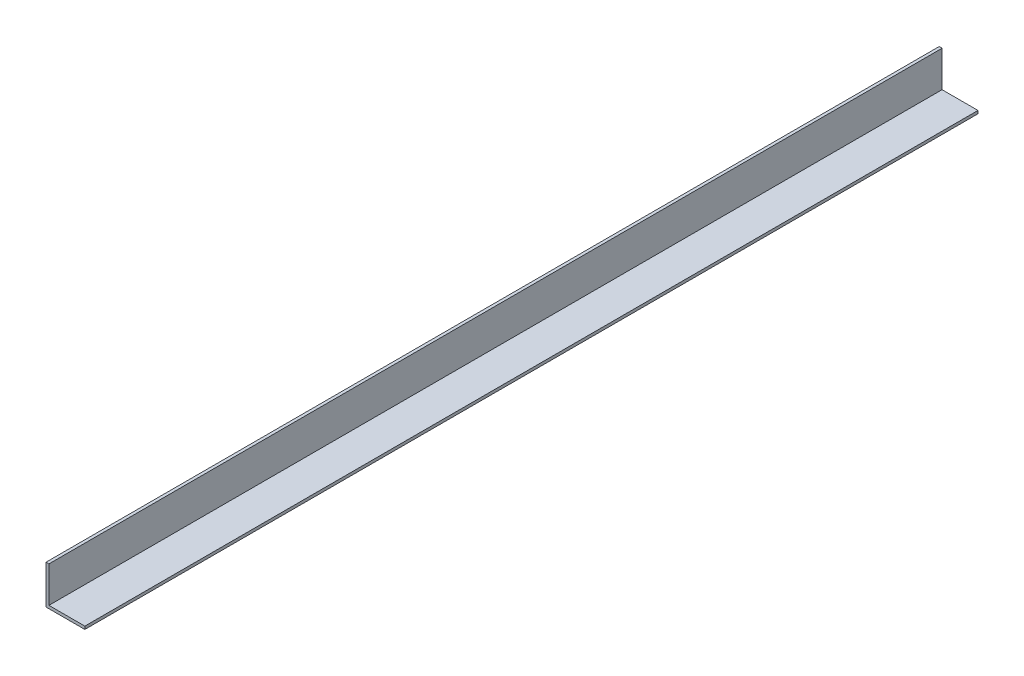
ISO-10303-21;
HEADER;
FILE_DESCRIPTION(('STEP AP214'),'2;1');
FILE_NAME('part.step','',(''),(''),'','','');
FILE_SCHEMA(('AUTOMOTIVE_DESIGN { 1 0 10303 214 1 1 1 1 }'));
ENDSEC;
DATA;
#1=APPLICATION_CONTEXT('core data for automotive mechanical design processes');
#2=APPLICATION_PROTOCOL_DEFINITION('international standard','automotive_design',2000,#1);
#3=PRODUCT_CONTEXT('',#1,'mechanical');
#4=PRODUCT('Part','Part','',(#3));
#5=PRODUCT_RELATED_PRODUCT_CATEGORY('part','',(#4));
#6=PRODUCT_DEFINITION_FORMATION('','',#4);
#7=PRODUCT_DEFINITION_CONTEXT('part definition',#1,'design');
#8=PRODUCT_DEFINITION('design','',#6,#7);
#9=PRODUCT_DEFINITION_SHAPE('','',#8);
#10=(LENGTH_UNIT() NAMED_UNIT(*) SI_UNIT(.MILLI.,.METRE.));
#11=(NAMED_UNIT(*) PLANE_ANGLE_UNIT() SI_UNIT($,.RADIAN.));
#12=(NAMED_UNIT(*) SI_UNIT($,.STERADIAN.) SOLID_ANGLE_UNIT());
#13=UNCERTAINTY_MEASURE_WITH_UNIT(LENGTH_MEASURE(1.E-05),#10,'distance_accuracy_value','');
#14=(GEOMETRIC_REPRESENTATION_CONTEXT(3) GLOBAL_UNCERTAINTY_ASSIGNED_CONTEXT((#13)) GLOBAL_UNIT_ASSIGNED_CONTEXT((#10,
#11,#12)) REPRESENTATION_CONTEXT('',''));
#15=CARTESIAN_POINT('',(0.,0.,0.));
#16=DIRECTION('',(0.,0.,1.));
#17=DIRECTION('',(1.,0.,0.));
#18=AXIS2_PLACEMENT_3D('',#15,#16,#17);
#19=CARTESIAN_POINT('',(1.5,0.,230.));
#20=DIRECTION('',(-1.,0.,0.));
#21=DIRECTION('',(0.,0.,1.));
#22=AXIS2_PLACEMENT_3D('',#19,#20,#21);
#23=PLANE('',#22);
#24=DIRECTION('',(0.,1.,0.));
#25=VECTOR('',#24,1.);
#26=CARTESIAN_POINT('',(1.5,0.,-230.));
#27=LINE('',#26,#25);
#28=CARTESIAN_POINT('',(1.5,1.5,-230.));
#29=VERTEX_POINT('',#28);
#30=CARTESIAN_POINT('',(1.5,20.,-230.));
#31=VERTEX_POINT('',#30);
#32=EDGE_CURVE('E120',#29,#31,#27,.T.);
#33=ORIENTED_EDGE('',*,*,#32,.T.);
#34=DIRECTION('',(0.,0.,-1.));
#35=VECTOR('',#34,1.);
#36=CARTESIAN_POINT('',(1.5,20.,230.));
#37=LINE('',#36,#35);
#38=CARTESIAN_POINT('',(1.5,20.,230.));
#39=VERTEX_POINT('',#38);
#40=EDGE_CURVE('E11',#39,#31,#37,.T.);
#41=ORIENTED_EDGE('',*,*,#40,.F.);
#42=DIRECTION('',(0.,1.,0.));
#43=VECTOR('',#42,1.);
#44=CARTESIAN_POINT('',(1.5,0.,230.));
#45=LINE('',#44,#43);
#46=CARTESIAN_POINT('',(1.5,1.5,230.));
#47=VERTEX_POINT('',#46);
#48=EDGE_CURVE('E85',#47,#39,#45,.T.);
#49=ORIENTED_EDGE('',*,*,#48,.F.);
#50=DIRECTION('',(0.,0.,-1.));
#51=VECTOR('',#50,1.);
#52=CARTESIAN_POINT('',(1.5,1.5,230.));
#53=LINE('',#52,#51);
#54=EDGE_CURVE('E116',#47,#29,#53,.T.);
#55=ORIENTED_EDGE('',*,*,#54,.T.);
#56=EDGE_LOOP('',(#33,#41,#49,#55));
#57=FACE_BOUND('',#56,.T.);
#58=ADVANCED_FACE('F39',(#57),#23,.F.);
#59=CARTESIAN_POINT('',(0.,20.,230.));
#60=DIRECTION('',(0.,1.,0.));
#61=DIRECTION('',(0.,0.,1.));
#62=AXIS2_PLACEMENT_3D('',#59,#60,#61);
#63=PLANE('',#62);
#64=DIRECTION('',(1.,0.,0.));
#65=VECTOR('',#64,1.);
#66=CARTESIAN_POINT('',(0.,20.,-230.));
#67=LINE('',#66,#65);
#68=CARTESIAN_POINT('',(0.,20.,-230.));
#69=VERTEX_POINT('',#68);
#70=EDGE_CURVE('E123',#69,#31,#67,.T.);
#71=ORIENTED_EDGE('',*,*,#70,.F.);
#72=DIRECTION('',(0.,0.,-1.));
#73=VECTOR('',#72,1.);
#74=CARTESIAN_POINT('',(0.,20.,230.));
#75=LINE('',#74,#73);
#76=CARTESIAN_POINT('',(0.,20.,230.));
#77=VERTEX_POINT('',#76);
#78=EDGE_CURVE('E47',#77,#69,#75,.T.);
#79=ORIENTED_EDGE('',*,*,#78,.F.);
#80=DIRECTION('',(1.,0.,0.));
#81=VECTOR('',#80,1.);
#82=CARTESIAN_POINT('',(0.,20.,230.));
#83=LINE('',#82,#81);
#84=EDGE_CURVE('E213',#77,#39,#83,.T.);
#85=ORIENTED_EDGE('',*,*,#84,.T.);
#86=ORIENTED_EDGE('',*,*,#40,.T.);
#87=EDGE_LOOP('',(#71,#79,#85,#86));
#88=FACE_BOUND('',#87,.T.);
#89=ADVANCED_FACE('F143',(#88),#63,.T.);
#90=CARTESIAN_POINT('',(0.,0.,230.));
#91=DIRECTION('',(-1.,0.,0.));
#92=DIRECTION('',(0.,0.,1.));
#93=AXIS2_PLACEMENT_3D('',#90,#91,#92);
#94=PLANE('',#93);
#95=DIRECTION('',(0.,1.,0.));
#96=VECTOR('',#95,1.);
#97=CARTESIAN_POINT('',(0.,0.,-230.));
#98=LINE('',#97,#96);
#99=CARTESIAN_POINT('',(0.,0.,-230.));
#100=VERTEX_POINT('',#99);
#101=EDGE_CURVE('E126',#100,#69,#98,.T.);
#102=ORIENTED_EDGE('',*,*,#101,.F.);
#103=DIRECTION('',(0.,0.,-1.));
#104=VECTOR('',#103,1.);
#105=CARTESIAN_POINT('',(0.,0.,230.));
#106=LINE('',#105,#104);
#107=CARTESIAN_POINT('',(0.,0.,230.));
#108=VERTEX_POINT('',#107);
#109=EDGE_CURVE('E106',#108,#100,#106,.T.);
#110=ORIENTED_EDGE('',*,*,#109,.F.);
#111=DIRECTION('',(0.,1.,0.));
#112=VECTOR('',#111,1.);
#113=CARTESIAN_POINT('',(0.,0.,230.));
#114=LINE('',#113,#112);
#115=EDGE_CURVE('E112',#108,#77,#114,.T.);
#116=ORIENTED_EDGE('',*,*,#115,.T.);
#117=ORIENTED_EDGE('',*,*,#78,.T.);
#118=EDGE_LOOP('',(#102,#110,#116,#117));
#119=FACE_BOUND('',#118,.T.);
#120=ADVANCED_FACE('F140',(#119),#94,.T.);
#121=CARTESIAN_POINT('',(0.,0.,230.));
#122=DIRECTION('',(0.,-1.,0.));
#123=DIRECTION('',(0.,0.,-1.));
#124=AXIS2_PLACEMENT_3D('',#121,#122,#123);
#125=PLANE('',#124);
#126=DIRECTION('',(-1.,0.,0.));
#127=VECTOR('',#126,1.);
#128=CARTESIAN_POINT('',(0.,0.,-230.));
#129=LINE('',#128,#127);
#130=CARTESIAN_POINT('',(20.,0.,-230.));
#131=VERTEX_POINT('',#130);
#132=EDGE_CURVE('E101',#131,#100,#129,.T.);
#133=ORIENTED_EDGE('',*,*,#132,.F.);
#134=DIRECTION('',(0.,0.,-1.));
#135=VECTOR('',#134,1.);
#136=CARTESIAN_POINT('',(20.,0.,230.));
#137=LINE('',#136,#135);
#138=CARTESIAN_POINT('',(20.,0.,230.));
#139=VERTEX_POINT('',#138);
#140=EDGE_CURVE('E96',#139,#131,#137,.T.);
#141=ORIENTED_EDGE('',*,*,#140,.F.);
#142=DIRECTION('',(-1.,0.,0.));
#143=VECTOR('',#142,1.);
#144=CARTESIAN_POINT('',(0.,0.,230.));
#145=LINE('',#144,#143);
#146=EDGE_CURVE('E99',#139,#108,#145,.T.);
#147=ORIENTED_EDGE('',*,*,#146,.T.);
#148=ORIENTED_EDGE('',*,*,#109,.T.);
#149=EDGE_LOOP('',(#133,#141,#147,#148));
#150=FACE_BOUND('',#149,.T.);
#151=ADVANCED_FACE('F98',(#150),#125,.T.);
#152=CARTESIAN_POINT('',(20.,1.5,230.));
#153=DIRECTION('',(1.,0.,0.));
#154=DIRECTION('',(0.,0.,-1.));
#155=AXIS2_PLACEMENT_3D('',#152,#153,#154);
#156=PLANE('',#155);
#157=DIRECTION('',(0.,-1.,0.));
#158=VECTOR('',#157,1.);
#159=CARTESIAN_POINT('',(20.,1.5,-230.));
#160=LINE('',#159,#158);
#161=CARTESIAN_POINT('',(20.,1.5,-230.));
#162=VERTEX_POINT('',#161);
#163=EDGE_CURVE('E130',#162,#131,#160,.T.);
#164=ORIENTED_EDGE('',*,*,#163,.F.);
#165=DIRECTION('',(0.,0.,-1.));
#166=VECTOR('',#165,1.);
#167=CARTESIAN_POINT('',(20.,1.5,230.));
#168=LINE('',#167,#166);
#169=CARTESIAN_POINT('',(20.,1.5,230.));
#170=VERTEX_POINT('',#169);
#171=EDGE_CURVE('E76',#170,#162,#168,.T.);
#172=ORIENTED_EDGE('',*,*,#171,.F.);
#173=DIRECTION('',(0.,-1.,0.));
#174=VECTOR('',#173,1.);
#175=CARTESIAN_POINT('',(20.,1.5,230.));
#176=LINE('',#175,#174);
#177=EDGE_CURVE('E110',#170,#139,#176,.T.);
#178=ORIENTED_EDGE('',*,*,#177,.T.);
#179=ORIENTED_EDGE('',*,*,#140,.T.);
#180=EDGE_LOOP('',(#164,#172,#178,#179));
#181=FACE_BOUND('',#180,.T.);
#182=ADVANCED_FACE('F114',(#181),#156,.T.);
#183=CARTESIAN_POINT('',(0.,1.5,230.));
#184=DIRECTION('',(0.,-1.,0.));
#185=DIRECTION('',(0.,0.,-1.));
#186=AXIS2_PLACEMENT_3D('',#183,#184,#185);
#187=PLANE('',#186);
#188=DIRECTION('',(1.,0.,0.));
#189=VECTOR('',#188,1.);
#190=CARTESIAN_POINT('',(0.,1.5,-230.));
#191=LINE('',#190,#189);
#192=EDGE_CURVE('E79',#162,#29,#191,.F.);
#193=ORIENTED_EDGE('',*,*,#192,.T.);
#194=ORIENTED_EDGE('',*,*,#54,.F.);
#195=DIRECTION('',(1.,0.,0.));
#196=VECTOR('',#195,1.);
#197=CARTESIAN_POINT('',(0.,1.5,230.));
#198=LINE('',#197,#196);
#199=EDGE_CURVE('E55',#170,#47,#198,.F.);
#200=ORIENTED_EDGE('',*,*,#199,.F.);
#201=ORIENTED_EDGE('',*,*,#171,.T.);
#202=EDGE_LOOP('',(#193,#194,#200,#201));
#203=FACE_BOUND('',#202,.T.);
#204=ADVANCED_FACE('F148',(#203),#187,.F.);
#205=CARTESIAN_POINT('',(0.,0.,230.));
#206=DIRECTION('',(0.,0.,-1.));
#207=DIRECTION('',(-1.,0.,0.));
#208=AXIS2_PLACEMENT_3D('',#205,#206,#207);
#209=PLANE('',#208);
#210=ORIENTED_EDGE('',*,*,#48,.T.);
#211=ORIENTED_EDGE('',*,*,#84,.F.);
#212=ORIENTED_EDGE('',*,*,#115,.F.);
#213=ORIENTED_EDGE('',*,*,#146,.F.);
#214=ORIENTED_EDGE('',*,*,#177,.F.);
#215=ORIENTED_EDGE('',*,*,#199,.T.);
#216=EDGE_LOOP('',(#210,#211,#212,#213,#214,#215));
#217=FACE_BOUND('',#216,.T.);
#218=ADVANCED_FACE('F109',(#217),#209,.F.);
#219=CARTESIAN_POINT('',(0.,0.,-230.));
#220=DIRECTION('',(0.,0.,-1.));
#221=DIRECTION('',(-1.,0.,0.));
#222=AXIS2_PLACEMENT_3D('',#219,#220,#221);
#223=PLANE('',#222);
#224=ORIENTED_EDGE('',*,*,#32,.F.);
#225=ORIENTED_EDGE('',*,*,#192,.F.);
#226=ORIENTED_EDGE('',*,*,#163,.T.);
#227=ORIENTED_EDGE('',*,*,#132,.T.);
#228=ORIENTED_EDGE('',*,*,#101,.T.);
#229=ORIENTED_EDGE('',*,*,#70,.T.);
#230=EDGE_LOOP('',(#224,#225,#226,#227,#228,#229));
#231=FACE_BOUND('',#230,.T.);
#232=ADVANCED_FACE('F146',(#231),#223,.T.);
#233=CLOSED_SHELL('',(#58,#89,#120,#151,#182,#204,#218,#232));
#234=MANIFOLD_SOLID_BREP('B2',#233);
#235=ADVANCED_BREP_SHAPE_REPRESENTATION('',(#18,#234),#14);
#236=SHAPE_DEFINITION_REPRESENTATION(#9,#235);
ENDSEC;
END-ISO-10303-21;
